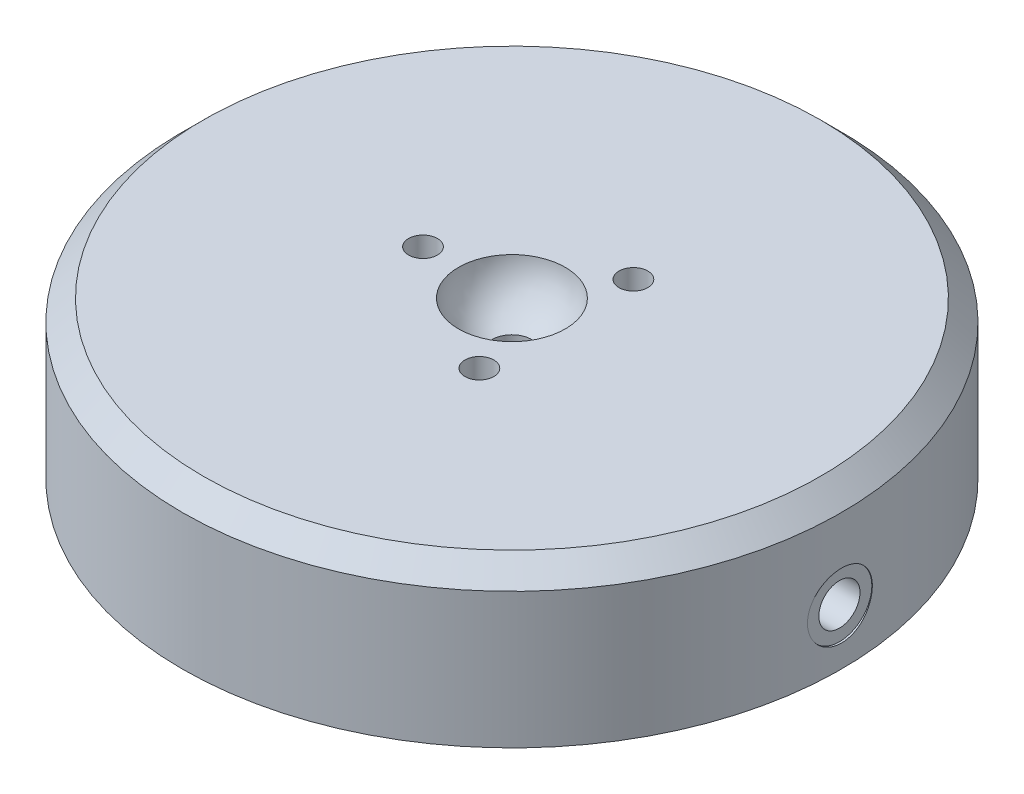
ISO-10303-21;
HEADER;
FILE_DESCRIPTION(('STEP AP214'),'2;1');
FILE_NAME('part.step','',(''),(''),'','','');
FILE_SCHEMA(('AUTOMOTIVE_DESIGN { 1 0 10303 214 1 1 1 1 }'));
ENDSEC;
DATA;
#1=APPLICATION_CONTEXT('core data for automotive mechanical design processes');
#2=APPLICATION_PROTOCOL_DEFINITION('international standard','automotive_design',2000,#1);
#3=PRODUCT_CONTEXT('',#1,'mechanical');
#4=PRODUCT('Part','Part','',(#3));
#5=PRODUCT_RELATED_PRODUCT_CATEGORY('part','',(#4));
#6=PRODUCT_DEFINITION_FORMATION('','',#4);
#7=PRODUCT_DEFINITION_CONTEXT('part definition',#1,'design');
#8=PRODUCT_DEFINITION('design','',#6,#7);
#9=PRODUCT_DEFINITION_SHAPE('','',#8);
#10=(LENGTH_UNIT() NAMED_UNIT(*) SI_UNIT(.MILLI.,.METRE.));
#11=(NAMED_UNIT(*) PLANE_ANGLE_UNIT() SI_UNIT($,.RADIAN.));
#12=(NAMED_UNIT(*) SI_UNIT($,.STERADIAN.) SOLID_ANGLE_UNIT());
#13=UNCERTAINTY_MEASURE_WITH_UNIT(LENGTH_MEASURE(1.E-05),#10,'distance_accuracy_value','');
#14=(GEOMETRIC_REPRESENTATION_CONTEXT(3) GLOBAL_UNCERTAINTY_ASSIGNED_CONTEXT((#13)) GLOBAL_UNIT_ASSIGNED_CONTEXT((#10,
#11,#12)) REPRESENTATION_CONTEXT('',''));
#15=CARTESIAN_POINT('',(0.,0.,0.));
#16=DIRECTION('',(0.,0.,1.));
#17=DIRECTION('',(1.,0.,0.));
#18=AXIS2_PLACEMENT_3D('',#15,#16,#17);
#19=CARTESIAN_POINT('',(0.,18.9992,0.));
#20=DIRECTION('',(0.,1.,0.));
#21=DIRECTION('',(0.,0.,1.));
#22=AXIS2_PLACEMENT_3D('',#19,#20,#21);
#23=PLANE('',#22);
#24=CARTESIAN_POINT('',(0.,18.9992,0.));
#25=DIRECTION('',(0.,1.,0.));
#26=DIRECTION('',(0.,0.,1.));
#27=AXIS2_PLACEMENT_3D('',#24,#25,#26);
#28=CIRCLE('',#27,37.465);
#29=CARTESIAN_POINT('',(0.,18.9992,37.465));
#30=VERTEX_POINT('',#29);
#31=EDGE_CURVE('E129',#30,#30,#28,.T.);
#32=ORIENTED_EDGE('',*,*,#31,.T.);
#33=EDGE_LOOP('',(#32));
#34=FACE_BOUND('',#33,.T.);
#35=CARTESIAN_POINT('',(-10.795,18.9992,0.));
#36=DIRECTION('',(0.,1.,0.));
#37=DIRECTION('',(0.,0.,1.));
#38=AXIS2_PLACEMENT_3D('',#35,#36,#37);
#39=CIRCLE('',#38,1.75);
#40=CARTESIAN_POINT('',(-10.795,18.9992,1.75));
#41=VERTEX_POINT('',#40);
#42=EDGE_CURVE('E102',#41,#41,#39,.T.);
#43=ORIENTED_EDGE('',*,*,#42,.F.);
#44=EDGE_LOOP('',(#43));
#45=FACE_BOUND('',#44,.T.);
#46=CARTESIAN_POINT('',(5.39750000000004,18.9992,-9.34874423385299));
#47=DIRECTION('',(0.,1.,0.));
#48=DIRECTION('',(0.,0.,1.));
#49=AXIS2_PLACEMENT_3D('',#46,#47,#48);
#50=CIRCLE('',#49,1.75);
#51=CARTESIAN_POINT('',(5.39750000000004,18.9992,-7.59874423385299));
#52=VERTEX_POINT('',#51);
#53=EDGE_CURVE('E90',#52,#52,#50,.T.);
#54=ORIENTED_EDGE('',*,*,#53,.F.);
#55=EDGE_LOOP('',(#54));
#56=FACE_BOUND('',#55,.T.);
#57=CARTESIAN_POINT('',(5.39749999999991,18.9992,9.34874423385306));
#58=DIRECTION('',(0.,1.,0.));
#59=DIRECTION('',(0.,0.,1.));
#60=AXIS2_PLACEMENT_3D('',#57,#58,#59);
#61=CIRCLE('',#60,1.75);
#62=CARTESIAN_POINT('',(5.39749999999991,18.9992,11.0987442338531));
#63=VERTEX_POINT('',#62);
#64=EDGE_CURVE('E78',#63,#63,#61,.T.);
#65=ORIENTED_EDGE('',*,*,#64,.F.);
#66=EDGE_LOOP('',(#65));
#67=FACE_BOUND('',#66,.T.);
#68=CARTESIAN_POINT('',(0.,18.9992,0.));
#69=DIRECTION('',(0.,1.,0.));
#70=DIRECTION('',(0.,0.,1.));
#71=AXIS2_PLACEMENT_3D('',#68,#69,#70);
#72=CIRCLE('',#71,6.48011851743469);
#73=CARTESIAN_POINT('',(0.,18.9992,6.48011851743469));
#74=VERTEX_POINT('',#73);
#75=EDGE_CURVE('E72',#74,#74,#72,.T.);
#76=ORIENTED_EDGE('',*,*,#75,.F.);
#77=EDGE_LOOP('',(#76));
#78=FACE_BOUND('',#77,.T.);
#79=ADVANCED_FACE('F34',(#34,#45,#56,#67,#78),#23,.T.);
#80=CARTESIAN_POINT('',(0.,0.,0.));
#81=DIRECTION('',(0.,1.,0.));
#82=DIRECTION('',(0.,0.,1.));
#83=AXIS2_PLACEMENT_3D('',#80,#81,#82);
#84=PLANE('',#83);
#85=CARTESIAN_POINT('',(0.,0.,0.));
#86=DIRECTION('',(0.,1.,0.));
#87=DIRECTION('',(0.,0.,1.));
#88=AXIS2_PLACEMENT_3D('',#85,#86,#87);
#89=CIRCLE('',#88,40.005);
#90=CARTESIAN_POINT('',(0.,0.,40.005));
#91=VERTEX_POINT('',#90);
#92=EDGE_CURVE('E118',#91,#91,#89,.T.);
#93=ORIENTED_EDGE('',*,*,#92,.F.);
#94=EDGE_LOOP('',(#93));
#95=FACE_BOUND('',#94,.T.);
#96=CARTESIAN_POINT('',(0.,0.,0.));
#97=DIRECTION('',(0.,1.,0.));
#98=DIRECTION('',(0.,0.,1.));
#99=AXIS2_PLACEMENT_3D('',#96,#97,#98);
#100=CIRCLE('',#99,38.1);
#101=CARTESIAN_POINT('',(0.,0.,38.1));
#102=VERTEX_POINT('',#101);
#103=EDGE_CURVE('E11',#102,#102,#100,.F.);
#104=ORIENTED_EDGE('',*,*,#103,.F.);
#105=EDGE_LOOP('',(#104));
#106=FACE_BOUND('',#105,.T.);
#107=ADVANCED_FACE('F159',(#95,#106),#84,.F.);
#108=CARTESIAN_POINT('',(40.005,6.6802,0.));
#109=DIRECTION('',(1.,0.,0.));
#110=DIRECTION('',(0.,0.,-1.));
#111=AXIS2_PLACEMENT_3D('',#108,#109,#110);
#112=CYLINDRICAL_SURFACE('',#111,2.5);
#113=CARTESIAN_POINT('',(39.751,6.6802,0.));
#114=DIRECTION('',(-1.,0.,0.));
#115=DIRECTION('',(0.,0.,1.));
#116=AXIS2_PLACEMENT_3D('',#113,#114,#115);
#117=CIRCLE('',#116,2.5);
#118=CARTESIAN_POINT('',(39.751,6.6802,2.5));
#119=VERTEX_POINT('',#118);
#120=EDGE_CURVE('E108',#119,#119,#117,.F.);
#121=ORIENTED_EDGE('',*,*,#120,.T.);
#122=EDGE_LOOP('',(#121));
#123=FACE_BOUND('',#122,.T.);
#124=CARTESIAN_POINT('',(32.385,6.6802,0.));
#125=DIRECTION('',(1.,0.,0.));
#126=DIRECTION('',(0.,0.,-1.));
#127=AXIS2_PLACEMENT_3D('',#124,#125,#126);
#128=CIRCLE('',#127,2.5);
#129=CARTESIAN_POINT('',(32.385,6.6802,-2.49999999999999));
#130=VERTEX_POINT('',#129);
#131=EDGE_CURVE('E115',#130,#130,#128,.T.);
#132=ORIENTED_EDGE('',*,*,#131,.F.);
#133=EDGE_LOOP('',(#132));
#134=FACE_BOUND('',#133,.T.);
#135=ADVANCED_FACE('F155',(#123,#134),#112,.F.);
#136=CARTESIAN_POINT('',(32.385,8.7802,0.));
#137=DIRECTION('',(-1.,0.,0.));
#138=DIRECTION('',(0.,0.,1.));
#139=AXIS2_PLACEMENT_3D('',#136,#137,#138);
#140=PLANE('',#139);
#141=CARTESIAN_POINT('',(32.385,6.6802,0.));
#142=DIRECTION('',(1.,0.,0.));
#143=DIRECTION('',(0.,0.,-1.));
#144=AXIS2_PLACEMENT_3D('',#141,#142,#143);
#145=CIRCLE('',#144,2.09999999999999);
#146=CARTESIAN_POINT('',(32.385,6.6802,-2.09999999999999));
#147=VERTEX_POINT('',#146);
#148=EDGE_CURVE('E112',#147,#147,#145,.T.);
#149=ORIENTED_EDGE('',*,*,#148,.F.);
#150=EDGE_LOOP('',(#149));
#151=FACE_BOUND('',#150,.T.);
#152=ORIENTED_EDGE('',*,*,#131,.T.);
#153=EDGE_LOOP('',(#152));
#154=FACE_BOUND('',#153,.T.);
#155=ADVANCED_FACE('F151',(#151,#154),#140,.F.);
#156=CARTESIAN_POINT('',(40.005,6.6802,0.));
#157=DIRECTION('',(1.,0.,0.));
#158=DIRECTION('',(0.,0.,-1.));
#159=AXIS2_PLACEMENT_3D('',#156,#157,#158);
#160=CYLINDRICAL_SURFACE('',#159,2.09999999999999);
#161=CARTESIAN_POINT('',(4.44500000000001,6.6802,0.));
#162=DIRECTION('',(1.,0.,0.));
#163=DIRECTION('',(0.,0.,-1.));
#164=AXIS2_PLACEMENT_3D('',#161,#162,#163);
#165=CIRCLE('',#164,2.09999999999999);
#166=CARTESIAN_POINT('',(4.44500000000001,6.6802,-2.09999999999999));
#167=VERTEX_POINT('',#166);
#168=EDGE_CURVE('E109',#167,#167,#165,.T.);
#169=ORIENTED_EDGE('',*,*,#168,.F.);
#170=EDGE_LOOP('',(#169));
#171=FACE_BOUND('',#170,.T.);
#172=ORIENTED_EDGE('',*,*,#148,.T.);
#173=EDGE_LOOP('',(#172));
#174=FACE_BOUND('',#173,.T.);
#175=ADVANCED_FACE('F148',(#171,#174),#160,.F.);
#176=CARTESIAN_POINT('',(4.44500000000001,6.6802,0.));
#177=DIRECTION('',(1.,0.,0.));
#178=DIRECTION('',(0.,0.,-1.));
#179=AXIS2_PLACEMENT_3D('',#176,#177,#178);
#180=CONICAL_SURFACE('',#179,2.09999999999999,1.02974425867665);
#181=CARTESIAN_POINT('',(3.18319270004213,6.68019999999999,0.));
#182=VERTEX_POINT('',#181);
#183=VERTEX_LOOP('',#182);
#184=FACE_BOUND('',#183,.T.);
#185=ORIENTED_EDGE('',*,*,#168,.T.);
#186=EDGE_LOOP('',(#185));
#187=FACE_BOUND('',#186,.T.);
#188=ADVANCED_FACE('F139',(#184,#187),#180,.F.);
#189=CARTESIAN_POINT('',(40.005,6.6802,0.));
#190=DIRECTION('',(1.,0.,0.));
#191=DIRECTION('',(0.,0.,-1.));
#192=AXIS2_PLACEMENT_3D('',#189,#190,#191);
#193=CYLINDRICAL_SURFACE('',#192,3.937);
#194=CARTESIAN_POINT('',(39.751,6.6802,0.));
#195=DIRECTION('',(1.,0.,0.));
#196=DIRECTION('',(0.,0.,-1.));
#197=AXIS2_PLACEMENT_3D('',#194,#195,#196);
#198=CIRCLE('',#197,3.937);
#199=CARTESIAN_POINT('',(39.751,6.6802,-3.937));
#200=VERTEX_POINT('',#199);
#201=EDGE_CURVE('E105',#200,#200,#198,.T.);
#202=ORIENTED_EDGE('',*,*,#201,.F.);
#203=EDGE_LOOP('',(#202));
#204=FACE_BOUND('',#203,.T.);
#205=CARTESIAN_POINT('',(39.8108032574074,6.6802,-3.937));
#206=CARTESIAN_POINT('',(39.810805805077,6.45963224359221,-3.93699043681316));
#207=CARTESIAN_POINT('',(39.8126560591812,6.23891820225793,-3.91840184186027));
#208=CARTESIAN_POINT('',(39.8198562364033,5.80360820855089,-3.84452836356141));
#209=CARTESIAN_POINT('',(39.8252100274078,5.58901929185503,-3.78920292193474));
#210=CARTESIAN_POINT('',(39.8388050998853,5.17232661007661,-3.64348123896554));
#211=CARTESIAN_POINT('',(39.8470446422456,4.97021541133468,-3.5531061169774));
#212=CARTESIAN_POINT('',(39.8654806861197,4.58407500076593,-3.3398907496245));
#213=CARTESIAN_POINT('',(39.8756767957956,4.40004217955579,-3.21705700283201));
#214=CARTESIAN_POINT('',(39.8969174125179,4.05458944566288,-2.94194560408975));
#215=CARTESIAN_POINT('',(39.9079644789283,3.89324222855482,-2.7895768582962));
#216=CARTESIAN_POINT('',(39.9296390292438,3.59836659334802,-2.45991512742036));
#217=CARTESIAN_POINT('',(39.940266494024,3.46483944206969,-2.28262100794637));
#218=CARTESIAN_POINT('',(39.9599295909891,3.22914392756265,-1.90769705897164));
#219=CARTESIAN_POINT('',(39.9689619484634,3.12703976308764,-1.71002668464034));
#220=CARTESIAN_POINT('',(39.984389303997,2.95749929215932,-1.30024298978307));
#221=CARTESIAN_POINT('',(39.9907843644705,2.89006216526833,-1.08813001119347));
#222=CARTESIAN_POINT('',(40.0001986199382,2.79198288837488,-0.656215665880754));
#223=CARTESIAN_POINT('',(40.0032287509014,2.76122151857953,-0.436441613777911));
#224=CARTESIAN_POINT('',(40.0056089125488,2.73699810599796,0.00516937442697141));
#225=CARTESIAN_POINT('',(40.0049590358748,2.74353512424839,0.227006258458157));
#226=CARTESIAN_POINT('',(40.0000613645618,2.79362607147928,0.66563654864535));
#227=CARTESIAN_POINT('',(39.995826030559,2.83705180192005,0.882444753446104));
#228=CARTESIAN_POINT('',(39.9842477887342,2.95948779924385,1.30568044109068));
#229=CARTESIAN_POINT('',(39.9769048416379,3.03849851585662,1.51210779270268));
#230=CARTESIAN_POINT('',(39.9599155595055,3.23000246339395,1.90912654945331));
#231=CARTESIAN_POINT('',(39.9502653224979,3.34255249460975,2.09969038295189));
#232=CARTESIAN_POINT('',(39.9297444643537,3.5978989445649,2.45927183190841));
#233=CARTESIAN_POINT('',(39.9188738085642,3.74069622225201,2.62828883527071));
#234=CARTESIAN_POINT('',(39.897077821978,4.05320482156085,2.94072959076786));
#235=CARTESIAN_POINT('',(39.8861524547282,4.22302765078635,3.08404183188699));
#236=CARTESIAN_POINT('',(39.8655244202471,4.58437989088981,3.34014182632578));
#237=CARTESIAN_POINT('',(39.8558217546993,4.77590933165162,3.45292953762111));
#238=CARTESIAN_POINT('',(39.8387367095103,5.17532291256083,3.64477792423565));
#239=CARTESIAN_POINT('',(39.8313547960755,5.38321032832202,3.72383182404428));
#240=CARTESIAN_POINT('',(39.819756619386,5.80939686787648,3.84588087591881));
#241=CARTESIAN_POINT('',(39.8155402627878,6.02769568446473,3.88887709122951));
#242=CARTESIAN_POINT('',(39.8107666349448,6.46752970215101,3.93744706141003));
#243=CARTESIAN_POINT('',(39.8101941152373,6.6890475230167,3.94317676865598));
#244=CARTESIAN_POINT('',(39.8127327418589,7.129890588757,3.91746053375646));
#245=CARTESIAN_POINT('',(39.8158438400095,7.34921586227038,3.88601507782958));
#246=CARTESIAN_POINT('',(39.82538528203,7.7789941202194,3.78697156738627));
#247=CARTESIAN_POINT('',(39.8318088637907,7.98946423845991,3.71944715439933));
#248=CARTESIAN_POINT('',(39.8472459932911,8.39609011423802,3.55023764911697));
#249=CARTESIAN_POINT('',(39.8562595985442,8.59224555378613,3.44855179823271));
#250=CARTESIAN_POINT('',(39.875898080348,8.96538506360173,3.21351482354118));
#251=CARTESIAN_POINT('',(39.8865281766698,9.1423037225359,3.0800602970297));
#252=CARTESIAN_POINT('',(39.90818474754,9.47128451180472,2.78542257948525));
#253=CARTESIAN_POINT('',(39.9192112315873,9.62334604596923,2.6242387235858));
#254=CARTESIAN_POINT('',(39.9404641293542,9.89883335372938,2.27804148123096));
#255=CARTESIAN_POINT('',(39.9506876193804,10.0221574330999,2.09294696688582));
#256=CARTESIAN_POINT('',(39.9691400911,10.2359695298368,1.70458364455489));
#257=CARTESIAN_POINT('',(39.9773690993722,10.3264579847833,1.50131507880857));
#258=CARTESIAN_POINT('',(39.9908921863186,10.4718576472343,1.08272965831202));
#259=CARTESIAN_POINT('',(39.9961913421227,10.5268304277565,0.867434362226739));
#260=CARTESIAN_POINT('',(40.003278460202,10.5998392462626,0.430614693307828));
#261=CARTESIAN_POINT('',(40.0050665178307,10.6178762873389,0.209090489803098));
#262=CARTESIAN_POINT('',(40.004929944898,10.6164877709316,-0.23289949186209));
#263=CARTESIAN_POINT('',(40.0030209661508,10.5972201469859,-0.453365788046622));
#264=CARTESIAN_POINT('',(39.9957357075674,10.5221002249909,-0.887913698610405));
#265=CARTESIAN_POINT('',(39.9903594247778,10.4662478957809,-1.10199530755141));
#266=CARTESIAN_POINT('',(39.9767420189108,10.3195873988298,-1.51769678996678));
#267=CARTESIAN_POINT('',(39.9685012599197,10.2287836733917,-1.71931824334201));
#268=CARTESIAN_POINT('',(39.9500738449442,10.0148149122715,-2.10448264455857));
#269=CARTESIAN_POINT('',(39.9398872023239,9.89165009883784,-2.28802571654613));
#270=CARTESIAN_POINT('',(39.9186578830576,9.61586296646528,-2.63263254983779));
#271=CARTESIAN_POINT('',(39.9076118993886,9.46312310095624,-2.79360203712765));
#272=CARTESIAN_POINT('',(39.8859368475614,9.13275181517137,-3.08769700323295));
#273=CARTESIAN_POINT('',(39.8753078801805,8.95511442494677,-3.22081578484423));
#274=CARTESIAN_POINT('',(39.8556421364935,8.57951204720464,-3.45568852131057));
#275=CARTESIAN_POINT('',(39.8466093623167,8.38149788021564,-3.55736410390164));
#276=CARTESIAN_POINT('',(39.8312065208862,7.97124572661228,-3.72588763694517));
#277=CARTESIAN_POINT('',(39.8248334459006,7.75902412354634,-3.79277494905879));
#278=CARTESIAN_POINT('',(39.8170820664101,7.4013630145004,-3.87310688178368));
#279=CARTESIAN_POINT('',(39.8147386156314,7.25821156795138,-3.89703414859334));
#280=CARTESIAN_POINT('',(39.8115983768622,6.97012781469923,-3.92898381893307));
#281=CARTESIAN_POINT('',(39.8108015826356,6.8251955151788,-3.93700628659069));
#282=CARTESIAN_POINT('',(39.8108032574074,6.6802,-3.937));
#283=B_SPLINE_CURVE_WITH_KNOTS('',3,(#205,#206,#207,#208,#209,#210,#211,#212,#213,#214,#215,
#216,#217,#218,#219,#220,#221,#222,#223,#224,#225,#226,#227,#228,#229,#230,#231,#232,#233,#234,
#235,#236,#237,#238,#239,#240,#241,#242,#243,#244,#245,#246,#247,#248,#249,#250,#251,#252,#253,
#254,#255,#256,#257,#258,#259,#260,#261,#262,#263,#264,#265,#266,#267,#268,#269,#270,#271,#272,
#273,#274,#275,#276,#277,#278,#279,#280,#281,#282),.UNSPECIFIED.,.T.,.F.,(4,2,2,2,2,2,2,2,2,2,2,
2,2,2,2,2,2,2,2,2,2,2,2,2,2,2,2,2,2,2,2,2,2,2,2,2,2,2,4),(0.,0.661173780580629,1.32307872780292,
1.9845854591113,2.64595984973914,3.30940752081,3.97288539617481,4.63770992701331,
5.30251872324495,5.96516051960164,6.62778563444337,7.28811731959191,7.9484573503706,
8.60992211353027,9.27140566318942,9.9356928533516,10.5999809580595,11.2644024237714,
11.9288042967801,12.5904239910976,13.2520350321048,13.9123007747853,14.572581180295,
15.2350408235038,15.8975163527304,16.562301764273,17.2270783163017,17.8906992398109,
18.5543021406139,19.2151017454661,19.8759019131471,20.5366181212122,21.1973297917495,
21.8607234710047,22.5242764923375,23.1894703337744,23.8539098862208,24.2885501121304,
24.7231885855833),.UNSPECIFIED.);
#284=CARTESIAN_POINT('',(39.8108032574074,6.6802,-3.937));
#285=VERTEX_POINT('',#284);
#286=EDGE_CURVE('E121',#285,#285,#283,.T.);
#287=ORIENTED_EDGE('',*,*,#286,.F.);
#288=EDGE_LOOP('',(#287));
#289=FACE_BOUND('',#288,.T.);
#290=ADVANCED_FACE('F133',(#204,#289),#193,.F.);
#291=CARTESIAN_POINT('',(39.751,8.5852,0.));
#292=DIRECTION('',(-1.,0.,0.));
#293=DIRECTION('',(0.,0.,1.));
#294=AXIS2_PLACEMENT_3D('',#291,#292,#293);
#295=PLANE('',#294);
#296=ORIENTED_EDGE('',*,*,#201,.T.);
#297=EDGE_LOOP('',(#296));
#298=FACE_BOUND('',#297,.T.);
#299=ORIENTED_EDGE('',*,*,#120,.F.);
#300=EDGE_LOOP('',(#299));
#301=FACE_BOUND('',#300,.T.);
#302=ADVANCED_FACE('F138',(#298,#301),#295,.F.);
#303=CARTESIAN_POINT('',(0.,18.9992,0.));
#304=DIRECTION('',(0.,-1.,0.));
#305=DIRECTION('',(0.,0.,-1.));
#306=AXIS2_PLACEMENT_3D('',#303,#304,#305);
#307=CYLINDRICAL_SURFACE('',#306,40.005);
#308=CARTESIAN_POINT('',(0.,16.4592,0.));
#309=DIRECTION('',(0.,1.,0.));
#310=DIRECTION('',(0.,0.,1.));
#311=AXIS2_PLACEMENT_3D('',#308,#309,#310);
#312=CIRCLE('',#311,40.005);
#313=CARTESIAN_POINT('',(0.,16.4592,40.005));
#314=VERTEX_POINT('',#313);
#315=EDGE_CURVE('E42',#314,#314,#312,.F.);
#316=ORIENTED_EDGE('',*,*,#315,.T.);
#317=EDGE_LOOP('',(#316));
#318=FACE_BOUND('',#317,.T.);
#319=ORIENTED_EDGE('',*,*,#286,.T.);
#320=EDGE_LOOP('',(#319));
#321=FACE_BOUND('',#320,.T.);
#322=ORIENTED_EDGE('',*,*,#92,.T.);
#323=EDGE_LOOP('',(#322));
#324=FACE_BOUND('',#323,.T.);
#325=ADVANCED_FACE('F130',(#318,#321,#324),#307,.T.);
#326=CARTESIAN_POINT('',(0.,18.9992,0.));
#327=DIRECTION('',(0.,-1.,0.));
#328=DIRECTION('',(0.,0.,-1.));
#329=AXIS2_PLACEMENT_3D('',#326,#327,#328);
#330=CONICAL_SURFACE('',#329,37.465,0.785398163397448);
#331=ORIENTED_EDGE('',*,*,#315,.F.);
#332=EDGE_LOOP('',(#331));
#333=FACE_BOUND('',#332,.T.);
#334=ORIENTED_EDGE('',*,*,#31,.F.);
#335=EDGE_LOOP('',(#334));
#336=FACE_BOUND('',#335,.T.);
#337=ADVANCED_FACE('F36',(#333,#336),#330,.T.);
#338=CARTESIAN_POINT('',(-10.795,18.9992,0.));
#339=DIRECTION('',(0.,1.,0.));
#340=DIRECTION('',(0.,0.,1.));
#341=AXIS2_PLACEMENT_3D('',#338,#339,#340);
#342=CYLINDRICAL_SURFACE('',#341,1.75);
#343=CARTESIAN_POINT('',(-10.795,12.6492,0.));
#344=DIRECTION('',(0.,1.,0.));
#345=DIRECTION('',(0.,0.,1.));
#346=AXIS2_PLACEMENT_3D('',#343,#344,#345);
#347=CIRCLE('',#346,1.75);
#348=CARTESIAN_POINT('',(-10.795,12.6492,1.75));
#349=VERTEX_POINT('',#348);
#350=EDGE_CURVE('E99',#349,#349,#347,.T.);
#351=ORIENTED_EDGE('',*,*,#350,.F.);
#352=EDGE_LOOP('',(#351));
#353=FACE_BOUND('',#352,.T.);
#354=ORIENTED_EDGE('',*,*,#42,.T.);
#355=EDGE_LOOP('',(#354));
#356=FACE_BOUND('',#355,.T.);
#357=ADVANCED_FACE('F141',(#353,#356),#342,.F.);
#358=CARTESIAN_POINT('',(-9.345,12.6492,0.));
#359=DIRECTION('',(0.,-1.,0.));
#360=DIRECTION('',(0.,0.,-1.));
#361=AXIS2_PLACEMENT_3D('',#358,#359,#360);
#362=PLANE('',#361);
#363=CARTESIAN_POINT('',(-10.795,12.6492,0.));
#364=DIRECTION('',(0.,1.,0.));
#365=DIRECTION('',(0.,0.,1.));
#366=AXIS2_PLACEMENT_3D('',#363,#364,#365);
#367=CIRCLE('',#366,1.45);
#368=CARTESIAN_POINT('',(-10.795,12.6492,1.45));
#369=VERTEX_POINT('',#368);
#370=EDGE_CURVE('E96',#369,#369,#367,.T.);
#371=ORIENTED_EDGE('',*,*,#370,.F.);
#372=EDGE_LOOP('',(#371));
#373=FACE_BOUND('',#372,.T.);
#374=ORIENTED_EDGE('',*,*,#350,.T.);
#375=EDGE_LOOP('',(#374));
#376=FACE_BOUND('',#375,.T.);
#377=ADVANCED_FACE('F215',(#373,#376),#362,.F.);
#378=CARTESIAN_POINT('',(-10.795,18.9992,0.));
#379=DIRECTION('',(0.,1.,0.));
#380=DIRECTION('',(0.,0.,1.));
#381=AXIS2_PLACEMENT_3D('',#378,#379,#380);
#382=CYLINDRICAL_SURFACE('',#381,1.45);
#383=CARTESIAN_POINT('',(-10.795,9.3472,0.));
#384=DIRECTION('',(0.,1.,0.));
#385=DIRECTION('',(0.,0.,1.));
#386=AXIS2_PLACEMENT_3D('',#383,#384,#385);
#387=CIRCLE('',#386,1.45);
#388=CARTESIAN_POINT('',(-10.795,9.3472,1.45));
#389=VERTEX_POINT('',#388);
#390=EDGE_CURVE('E93',#389,#389,#387,.T.);
#391=ORIENTED_EDGE('',*,*,#390,.F.);
#392=EDGE_LOOP('',(#391));
#393=FACE_BOUND('',#392,.T.);
#394=ORIENTED_EDGE('',*,*,#370,.T.);
#395=EDGE_LOOP('',(#394));
#396=FACE_BOUND('',#395,.T.);
#397=ADVANCED_FACE('F213',(#393,#396),#382,.F.);
#398=CARTESIAN_POINT('',(-10.795,9.3472,0.));
#399=DIRECTION('',(0.,1.,0.));
#400=DIRECTION('',(0.,0.,1.));
#401=AXIS2_PLACEMENT_3D('',#398,#399,#400);
#402=CONICAL_SURFACE('',#401,1.45,1.02974425867665);
#403=CARTESIAN_POINT('',(-10.795,8.47595210241004,0.));
#404=VERTEX_POINT('',#403);
#405=VERTEX_LOOP('',#404);
#406=FACE_BOUND('',#405,.T.);
#407=ORIENTED_EDGE('',*,*,#390,.T.);
#408=EDGE_LOOP('',(#407));
#409=FACE_BOUND('',#408,.T.);
#410=ADVANCED_FACE('F209',(#406,#409),#402,.F.);
#411=CARTESIAN_POINT('',(5.39750000000004,18.9992,-9.34874423385299));
#412=DIRECTION('',(0.,1.,0.));
#413=DIRECTION('',(0.,0.,1.));
#414=AXIS2_PLACEMENT_3D('',#411,#412,#413);
#415=CYLINDRICAL_SURFACE('',#414,1.75);
#416=CARTESIAN_POINT('',(5.39750000000004,12.6492,-9.34874423385299));
#417=DIRECTION('',(0.,1.,0.));
#418=DIRECTION('',(0.,0.,1.));
#419=AXIS2_PLACEMENT_3D('',#416,#417,#418);
#420=CIRCLE('',#419,1.75);
#421=CARTESIAN_POINT('',(5.39750000000004,12.6492,-7.59874423385299));
#422=VERTEX_POINT('',#421);
#423=EDGE_CURVE('E87',#422,#422,#420,.T.);
#424=ORIENTED_EDGE('',*,*,#423,.F.);
#425=EDGE_LOOP('',(#424));
#426=FACE_BOUND('',#425,.T.);
#427=ORIENTED_EDGE('',*,*,#53,.T.);
#428=EDGE_LOOP('',(#427));
#429=FACE_BOUND('',#428,.T.);
#430=ADVANCED_FACE('F205',(#426,#429),#415,.F.);
#431=CARTESIAN_POINT('',(6.84750000000004,12.6492,-9.34874423385299));
#432=DIRECTION('',(0.,-1.,0.));
#433=DIRECTION('',(0.,0.,-1.));
#434=AXIS2_PLACEMENT_3D('',#431,#432,#433);
#435=PLANE('',#434);
#436=CARTESIAN_POINT('',(5.39750000000004,12.6492,-9.34874423385299));
#437=DIRECTION('',(0.,1.,0.));
#438=DIRECTION('',(0.,0.,1.));
#439=AXIS2_PLACEMENT_3D('',#436,#437,#438);
#440=CIRCLE('',#439,1.45);
#441=CARTESIAN_POINT('',(5.39750000000004,12.6492,-7.898744233853));
#442=VERTEX_POINT('',#441);
#443=EDGE_CURVE('E84',#442,#442,#440,.T.);
#444=ORIENTED_EDGE('',*,*,#443,.F.);
#445=EDGE_LOOP('',(#444));
#446=FACE_BOUND('',#445,.T.);
#447=ORIENTED_EDGE('',*,*,#423,.T.);
#448=EDGE_LOOP('',(#447));
#449=FACE_BOUND('',#448,.T.);
#450=ADVANCED_FACE('F201',(#446,#449),#435,.F.);
#451=CARTESIAN_POINT('',(5.39750000000004,18.9992,-9.34874423385299));
#452=DIRECTION('',(0.,1.,0.));
#453=DIRECTION('',(0.,0.,1.));
#454=AXIS2_PLACEMENT_3D('',#451,#452,#453);
#455=CYLINDRICAL_SURFACE('',#454,1.45);
#456=CARTESIAN_POINT('',(5.39750000000004,9.3472,-9.34874423385299));
#457=DIRECTION('',(0.,1.,0.));
#458=DIRECTION('',(0.,0.,1.));
#459=AXIS2_PLACEMENT_3D('',#456,#457,#458);
#460=CIRCLE('',#459,1.45);
#461=CARTESIAN_POINT('',(5.39750000000004,9.3472,-7.898744233853));
#462=VERTEX_POINT('',#461);
#463=EDGE_CURVE('E81',#462,#462,#460,.T.);
#464=ORIENTED_EDGE('',*,*,#463,.F.);
#465=EDGE_LOOP('',(#464));
#466=FACE_BOUND('',#465,.T.);
#467=ORIENTED_EDGE('',*,*,#443,.T.);
#468=EDGE_LOOP('',(#467));
#469=FACE_BOUND('',#468,.T.);
#470=ADVANCED_FACE('F197',(#466,#469),#455,.F.);
#471=CARTESIAN_POINT('',(5.39750000000004,9.3472,-9.34874423385299));
#472=DIRECTION('',(0.,1.,0.));
#473=DIRECTION('',(0.,0.,1.));
#474=AXIS2_PLACEMENT_3D('',#471,#472,#473);
#475=CONICAL_SURFACE('',#474,1.45,1.02974425867665);
#476=CARTESIAN_POINT('',(5.39750000000004,8.47595210241004,-9.34874423385299));
#477=VERTEX_POINT('',#476);
#478=VERTEX_LOOP('',#477);
#479=FACE_BOUND('',#478,.T.);
#480=ORIENTED_EDGE('',*,*,#463,.T.);
#481=EDGE_LOOP('',(#480));
#482=FACE_BOUND('',#481,.T.);
#483=ADVANCED_FACE('F193',(#479,#482),#475,.F.);
#484=CARTESIAN_POINT('',(5.39749999999991,18.9992,9.34874423385306));
#485=DIRECTION('',(0.,1.,0.));
#486=DIRECTION('',(0.,0.,1.));
#487=AXIS2_PLACEMENT_3D('',#484,#485,#486);
#488=CYLINDRICAL_SURFACE('',#487,1.75);
#489=CARTESIAN_POINT('',(5.39749999999991,12.6492,9.34874423385306));
#490=DIRECTION('',(0.,1.,0.));
#491=DIRECTION('',(0.,0.,1.));
#492=AXIS2_PLACEMENT_3D('',#489,#490,#491);
#493=CIRCLE('',#492,1.75);
#494=CARTESIAN_POINT('',(5.39749999999991,12.6492,11.0987442338531));
#495=VERTEX_POINT('',#494);
#496=EDGE_CURVE('E69',#495,#495,#493,.T.);
#497=ORIENTED_EDGE('',*,*,#496,.F.);
#498=EDGE_LOOP('',(#497));
#499=FACE_BOUND('',#498,.T.);
#500=ORIENTED_EDGE('',*,*,#64,.T.);
#501=EDGE_LOOP('',(#500));
#502=FACE_BOUND('',#501,.T.);
#503=ADVANCED_FACE('F189',(#499,#502),#488,.F.);
#504=CARTESIAN_POINT('',(6.84749999999991,12.6492,9.34874423385306));
#505=DIRECTION('',(0.,-1.,0.));
#506=DIRECTION('',(0.,0.,-1.));
#507=AXIS2_PLACEMENT_3D('',#504,#505,#506);
#508=PLANE('',#507);
#509=CARTESIAN_POINT('',(5.39749999999991,12.6492,9.34874423385306));
#510=DIRECTION('',(0.,1.,0.));
#511=DIRECTION('',(0.,0.,1.));
#512=AXIS2_PLACEMENT_3D('',#509,#510,#511);
#513=CIRCLE('',#512,1.45);
#514=CARTESIAN_POINT('',(5.39749999999991,12.6492,10.7987442338531));
#515=VERTEX_POINT('',#514);
#516=EDGE_CURVE('E65',#515,#515,#513,.T.);
#517=ORIENTED_EDGE('',*,*,#516,.F.);
#518=EDGE_LOOP('',(#517));
#519=FACE_BOUND('',#518,.T.);
#520=ORIENTED_EDGE('',*,*,#496,.T.);
#521=EDGE_LOOP('',(#520));
#522=FACE_BOUND('',#521,.T.);
#523=ADVANCED_FACE('F186',(#519,#522),#508,.F.);
#524=CARTESIAN_POINT('',(5.39749999999991,18.9992,9.34874423385306));
#525=DIRECTION('',(0.,1.,0.));
#526=DIRECTION('',(0.,0.,1.));
#527=AXIS2_PLACEMENT_3D('',#524,#525,#526);
#528=CYLINDRICAL_SURFACE('',#527,1.45);
#529=CARTESIAN_POINT('',(5.39749999999991,9.3472,9.34874423385306));
#530=DIRECTION('',(0.,1.,0.));
#531=DIRECTION('',(0.,0.,1.));
#532=AXIS2_PLACEMENT_3D('',#529,#530,#531);
#533=CIRCLE('',#532,1.45);
#534=CARTESIAN_POINT('',(5.39749999999991,9.3472,10.7987442338531));
#535=VERTEX_POINT('',#534);
#536=EDGE_CURVE('E63',#535,#535,#533,.T.);
#537=ORIENTED_EDGE('',*,*,#536,.F.);
#538=EDGE_LOOP('',(#537));
#539=FACE_BOUND('',#538,.T.);
#540=ORIENTED_EDGE('',*,*,#516,.T.);
#541=EDGE_LOOP('',(#540));
#542=FACE_BOUND('',#541,.T.);
#543=ADVANCED_FACE('F59',(#539,#542),#528,.F.);
#544=CARTESIAN_POINT('',(5.39749999999991,9.3472,9.34874423385306));
#545=DIRECTION('',(0.,1.,0.));
#546=DIRECTION('',(0.,0.,1.));
#547=AXIS2_PLACEMENT_3D('',#544,#545,#546);
#548=CONICAL_SURFACE('',#547,1.45,1.02974425867665);
#549=CARTESIAN_POINT('',(5.39749999999991,8.47595210241004,9.34874423385306));
#550=VERTEX_POINT('',#549);
#551=VERTEX_LOOP('',#550);
#552=FACE_BOUND('',#551,.T.);
#553=ORIENTED_EDGE('',*,*,#536,.T.);
#554=EDGE_LOOP('',(#553));
#555=FACE_BOUND('',#554,.T.);
#556=ADVANCED_FACE('F55',(#552,#555),#548,.F.);
#557=CARTESIAN_POINT('',(0.,-1.00075996,0.));
#558=DIRECTION('',(0.,1.,0.));
#559=DIRECTION('',(0.,0.,1.));
#560=AXIS2_PLACEMENT_3D('',#557,#558,#559);
#561=CYLINDRICAL_SURFACE('',#560,38.1);
#562=CARTESIAN_POINT('',(0.,-1.00075996,0.));
#563=DIRECTION('',(0.,-1.,0.));
#564=DIRECTION('',(0.,0.,-1.));
#565=AXIS2_PLACEMENT_3D('',#562,#563,#564);
#566=CIRCLE('',#565,38.1);
#567=CARTESIAN_POINT('',(0.,-1.00075996,-38.1));
#568=VERTEX_POINT('',#567);
#569=EDGE_CURVE('E66',#568,#568,#566,.T.);
#570=ORIENTED_EDGE('',*,*,#569,.F.);
#571=EDGE_LOOP('',(#570));
#572=FACE_BOUND('',#571,.T.);
#573=ORIENTED_EDGE('',*,*,#103,.T.);
#574=EDGE_LOOP('',(#573));
#575=FACE_BOUND('',#574,.T.);
#576=ADVANCED_FACE('F58',(#572,#575),#561,.T.);
#577=CARTESIAN_POINT('',(0.,-1.00075996,0.));
#578=DIRECTION('',(0.,-1.,0.));
#579=DIRECTION('',(0.,0.,-1.));
#580=AXIS2_PLACEMENT_3D('',#577,#578,#579);
#581=PLANE('',#580);
#582=ORIENTED_EDGE('',*,*,#569,.T.);
#583=EDGE_LOOP('',(#582));
#584=FACE_BOUND('',#583,.T.);
#585=ADVANCED_FACE('F172',(#584),#581,.T.);
#586=CARTESIAN_POINT('',(0.,19.5072,0.));
#587=DIRECTION('',(0.,1.,0.));
#588=DIRECTION('',(1.,0.,0.));
#589=AXIS2_PLACEMENT_3D('',#586,#587,#588);
#590=SPHERICAL_SURFACE('',#589,6.5);
#591=ORIENTED_EDGE('',*,*,#75,.T.);
#592=EDGE_LOOP('',(#591));
#593=FACE_BOUND('',#592,.T.);
#594=CARTESIAN_POINT('',(0.,13.4615928146133,0.));
#595=DIRECTION('',(0.,1.,0.));
#596=DIRECTION('',(0.,0.,1.));
#597=AXIS2_PLACEMENT_3D('',#594,#595,#596);
#598=CIRCLE('',#597,2.3876);
#599=CARTESIAN_POINT('',(0.,13.4615928146133,2.3876));
#600=VERTEX_POINT('',#599);
#601=EDGE_CURVE('E239',#600,#600,#598,.T.);
#602=ORIENTED_EDGE('',*,*,#601,.F.);
#603=EDGE_LOOP('',(#602));
#604=FACE_BOUND('',#603,.T.);
#605=ADVANCED_FACE('F178',(#593,#604),#590,.F.);
#606=CARTESIAN_POINT('',(0.,12.7508,0.));
#607=DIRECTION('',(0.,1.,0.));
#608=DIRECTION('',(0.,0.,1.));
#609=AXIS2_PLACEMENT_3D('',#606,#607,#608);
#610=PLANE('',#609);
#611=CARTESIAN_POINT('',(0.,12.7508,0.));
#612=DIRECTION('',(0.,1.,0.));
#613=DIRECTION('',(0.,0.,1.));
#614=AXIS2_PLACEMENT_3D('',#611,#612,#613);
#615=CIRCLE('',#614,2.3876);
#616=CARTESIAN_POINT('',(0.,12.7508,2.3876));
#617=VERTEX_POINT('',#616);
#618=EDGE_CURVE('E237',#617,#617,#615,.T.);
#619=ORIENTED_EDGE('',*,*,#618,.T.);
#620=EDGE_LOOP('',(#619));
#621=FACE_BOUND('',#620,.T.);
#622=ADVANCED_FACE('F249',(#621),#610,.T.);
#623=CARTESIAN_POINT('',(0.,20.5784815374347,0.));
#624=DIRECTION('',(0.,1.,0.));
#625=DIRECTION('',(0.,0.,1.));
#626=AXIS2_PLACEMENT_3D('',#623,#624,#625);
#627=CYLINDRICAL_SURFACE('',#626,2.3876);
#628=ORIENTED_EDGE('',*,*,#601,.T.);
#629=EDGE_LOOP('',(#628));
#630=FACE_BOUND('',#629,.T.);
#631=ORIENTED_EDGE('',*,*,#618,.F.);
#632=EDGE_LOOP('',(#631));
#633=FACE_BOUND('',#632,.T.);
#634=ADVANCED_FACE('F245',(#630,#633),#627,.F.);
#635=CLOSED_SHELL('',(#79,#107,#135,#155,#175,#188,#290,#302,#325,#337,#357,#377,#397,#410,#430,
#450,#470,#483,#503,#523,#543,#556,#576,#585,#605,#622,#634));
#636=MANIFOLD_SOLID_BREP('B2',#635);
#637=ADVANCED_BREP_SHAPE_REPRESENTATION('',(#18,#636),#14);
#638=SHAPE_DEFINITION_REPRESENTATION(#9,#637);
ENDSEC;
END-ISO-10303-21;
